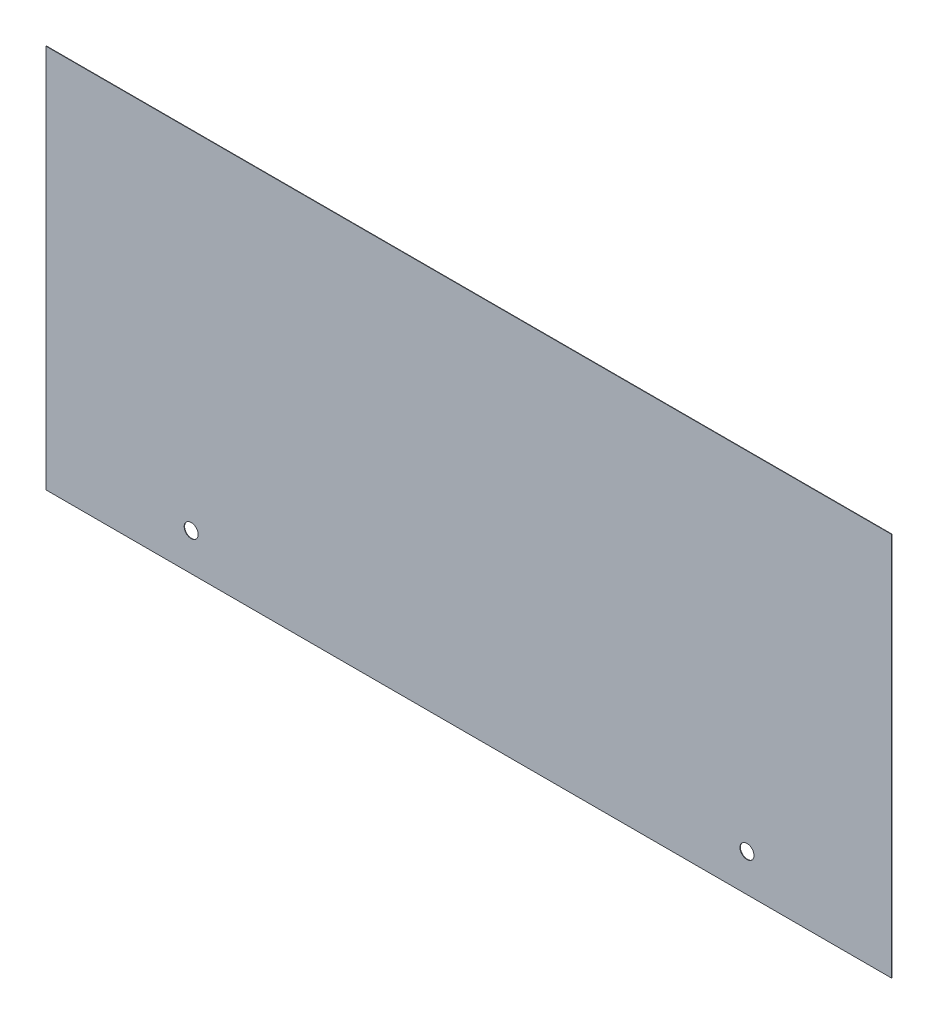
ISO-10303-21;
HEADER;
FILE_DESCRIPTION(('STEP AP214'),'2;1');
FILE_NAME('part.step','',(''),(''),'','','');
FILE_SCHEMA(('AUTOMOTIVE_DESIGN { 1 0 10303 214 1 1 1 1 }'));
ENDSEC;
DATA;
#1=APPLICATION_CONTEXT('core data for automotive mechanical design processes');
#2=APPLICATION_PROTOCOL_DEFINITION('international standard','automotive_design',2000,#1);
#3=PRODUCT_CONTEXT('',#1,'mechanical');
#4=PRODUCT('Part','Part','',(#3));
#5=PRODUCT_RELATED_PRODUCT_CATEGORY('part','',(#4));
#6=PRODUCT_DEFINITION_FORMATION('','',#4);
#7=PRODUCT_DEFINITION_CONTEXT('part definition',#1,'design');
#8=PRODUCT_DEFINITION('design','',#6,#7);
#9=PRODUCT_DEFINITION_SHAPE('','',#8);
#10=(LENGTH_UNIT() NAMED_UNIT(*) SI_UNIT(.MILLI.,.METRE.));
#11=(NAMED_UNIT(*) PLANE_ANGLE_UNIT() SI_UNIT($,.RADIAN.));
#12=(NAMED_UNIT(*) SI_UNIT($,.STERADIAN.) SOLID_ANGLE_UNIT());
#13=UNCERTAINTY_MEASURE_WITH_UNIT(LENGTH_MEASURE(1.E-05),#10,'distance_accuracy_value','');
#14=(GEOMETRIC_REPRESENTATION_CONTEXT(3) GLOBAL_UNCERTAINTY_ASSIGNED_CONTEXT((#13)) GLOBAL_UNIT_ASSIGNED_CONTEXT((#10,
#11,#12)) REPRESENTATION_CONTEXT('',''));
#15=CARTESIAN_POINT('',(0.,0.,0.));
#16=DIRECTION('',(0.,0.,1.));
#17=DIRECTION('',(1.,0.,0.));
#18=AXIS2_PLACEMENT_3D('',#15,#16,#17);
#19=CARTESIAN_POINT('',(-251.3838,-405.0538,0.254));
#20=DIRECTION('',(1.,0.,0.));
#21=DIRECTION('',(0.,0.,-1.));
#22=AXIS2_PLACEMENT_3D('',#19,#20,#21);
#23=PLANE('',#22);
#24=DIRECTION('',(0.,-1.,0.));
#25=VECTOR('',#24,1.);
#26=CARTESIAN_POINT('',(-251.3838,-405.0538,0.254));
#27=LINE('',#26,#25);
#28=CARTESIAN_POINT('',(-251.3838,-176.4538,0.254));
#29=VERTEX_POINT('',#28);
#30=CARTESIAN_POINT('',(-251.3838,-405.0538,0.254));
#31=VERTEX_POINT('',#30);
#32=EDGE_CURVE('E85',#29,#31,#27,.T.);
#33=ORIENTED_EDGE('',*,*,#32,.F.);
#34=DIRECTION('',(0.,0.,1.));
#35=VECTOR('',#34,1.);
#36=CARTESIAN_POINT('',(-251.3838,-176.4538,0.));
#37=LINE('',#36,#35);
#38=CARTESIAN_POINT('',(-251.3838,-176.4538,0.));
#39=VERTEX_POINT('',#38);
#40=EDGE_CURVE('E104',#39,#29,#37,.T.);
#41=ORIENTED_EDGE('',*,*,#40,.F.);
#42=DIRECTION('',(0.,-1.,0.));
#43=VECTOR('',#42,1.);
#44=CARTESIAN_POINT('',(-251.3838,-405.0538,0.));
#45=LINE('',#44,#43);
#46=CARTESIAN_POINT('',(-251.3838,-405.0538,0.));
#47=VERTEX_POINT('',#46);
#48=EDGE_CURVE('E77',#39,#47,#45,.T.);
#49=ORIENTED_EDGE('',*,*,#48,.T.);
#50=DIRECTION('',(0.,0.,-1.));
#51=VECTOR('',#50,1.);
#52=CARTESIAN_POINT('',(-251.3838,-405.0538,0.254));
#53=LINE('',#52,#51);
#54=EDGE_CURVE('E11',#31,#47,#53,.T.);
#55=ORIENTED_EDGE('',*,*,#54,.F.);
#56=EDGE_LOOP('',(#33,#41,#49,#55));
#57=FACE_BOUND('',#56,.T.);
#58=ADVANCED_FACE('F33',(#57),#23,.F.);
#59=CARTESIAN_POINT('',(251.3838,-405.0538,0.254));
#60=DIRECTION('',(0.,1.,0.));
#61=DIRECTION('',(-1.,0.,0.));
#62=AXIS2_PLACEMENT_3D('',#59,#60,#61);
#63=PLANE('',#62);
#64=DIRECTION('',(1.,0.,0.));
#65=VECTOR('',#64,1.);
#66=CARTESIAN_POINT('',(251.3838,-405.0538,0.));
#67=LINE('',#66,#65);
#68=CARTESIAN_POINT('',(251.3838,-405.0538,0.));
#69=VERTEX_POINT('',#68);
#70=EDGE_CURVE('E68',#47,#69,#67,.T.);
#71=ORIENTED_EDGE('',*,*,#70,.T.);
#72=DIRECTION('',(0.,0.,-1.));
#73=VECTOR('',#72,1.);
#74=CARTESIAN_POINT('',(251.3838,-405.0538,0.254));
#75=LINE('',#74,#73);
#76=CARTESIAN_POINT('',(251.3838,-405.0538,0.254));
#77=VERTEX_POINT('',#76);
#78=EDGE_CURVE('E40',#77,#69,#75,.T.);
#79=ORIENTED_EDGE('',*,*,#78,.F.);
#80=DIRECTION('',(1.,0.,0.));
#81=VECTOR('',#80,1.);
#82=CARTESIAN_POINT('',(251.3838,-405.0538,0.254));
#83=LINE('',#82,#81);
#84=EDGE_CURVE('E56',#31,#77,#83,.T.);
#85=ORIENTED_EDGE('',*,*,#84,.F.);
#86=ORIENTED_EDGE('',*,*,#54,.T.);
#87=EDGE_LOOP('',(#71,#79,#85,#86));
#88=FACE_BOUND('',#87,.T.);
#89=ADVANCED_FACE('F70',(#88),#63,.F.);
#90=CARTESIAN_POINT('',(251.3838,-405.0538,0.254));
#91=DIRECTION('',(-1.,0.,0.));
#92=DIRECTION('',(0.,0.,1.));
#93=AXIS2_PLACEMENT_3D('',#90,#91,#92);
#94=PLANE('',#93);
#95=DIRECTION('',(0.,1.,0.));
#96=VECTOR('',#95,1.);
#97=CARTESIAN_POINT('',(251.3838,-405.0538,0.));
#98=LINE('',#97,#96);
#99=CARTESIAN_POINT('',(251.3838,-176.4538,0.));
#100=VERTEX_POINT('',#99);
#101=EDGE_CURVE('E76',#69,#100,#98,.T.);
#102=ORIENTED_EDGE('',*,*,#101,.T.);
#103=DIRECTION('',(0.,0.,1.));
#104=VECTOR('',#103,1.);
#105=CARTESIAN_POINT('',(251.3838,-176.4538,0.));
#106=LINE('',#105,#104);
#107=CARTESIAN_POINT('',(251.3838,-176.4538,0.254));
#108=VERTEX_POINT('',#107);
#109=EDGE_CURVE('E47',#100,#108,#106,.T.);
#110=ORIENTED_EDGE('',*,*,#109,.T.);
#111=DIRECTION('',(0.,1.,0.));
#112=VECTOR('',#111,1.);
#113=CARTESIAN_POINT('',(251.3838,-405.0538,0.254));
#114=LINE('',#113,#112);
#115=EDGE_CURVE('E82',#77,#108,#114,.T.);
#116=ORIENTED_EDGE('',*,*,#115,.F.);
#117=ORIENTED_EDGE('',*,*,#78,.T.);
#118=EDGE_LOOP('',(#102,#110,#116,#117));
#119=FACE_BOUND('',#118,.T.);
#120=ADVANCED_FACE('F81',(#119),#94,.F.);
#121=CARTESIAN_POINT('',(0.,0.,0.254));
#122=DIRECTION('',(0.,0.,1.));
#123=DIRECTION('',(1.,0.,0.));
#124=AXIS2_PLACEMENT_3D('',#121,#122,#123);
#125=PLANE('',#124);
#126=DIRECTION('',(1.,0.,0.));
#127=VECTOR('',#126,1.);
#128=CARTESIAN_POINT('',(-251.3838,-176.4538,0.254));
#129=LINE('',#128,#127);
#130=EDGE_CURVE('E108',#29,#108,#129,.T.);
#131=ORIENTED_EDGE('',*,*,#130,.F.);
#132=ORIENTED_EDGE('',*,*,#32,.T.);
#133=ORIENTED_EDGE('',*,*,#84,.T.);
#134=ORIENTED_EDGE('',*,*,#115,.T.);
#135=EDGE_LOOP('',(#131,#132,#133,#134));
#136=FACE_BOUND('',#135,.T.);
#137=CARTESIAN_POINT('',(-165.1254,-382.8288,0.254));
#138=DIRECTION('',(0.,0.,-1.));
#139=DIRECTION('',(-1.,0.,0.));
#140=AXIS2_PLACEMENT_3D('',#137,#138,#139);
#141=CIRCLE('',#140,4.16559999999999);
#142=CARTESIAN_POINT('',(-169.291,-382.8288,0.254));
#143=VERTEX_POINT('',#142);
#144=EDGE_CURVE('E90',#143,#143,#141,.T.);
#145=ORIENTED_EDGE('',*,*,#144,.T.);
#146=EDGE_LOOP('',(#145));
#147=FACE_BOUND('',#146,.T.);
#148=CARTESIAN_POINT('',(165.481,-382.8288,0.254));
#149=DIRECTION('',(0.,0.,-1.));
#150=DIRECTION('',(-1.,0.,0.));
#151=AXIS2_PLACEMENT_3D('',#148,#149,#150);
#152=CIRCLE('',#151,4.16559999999999);
#153=CARTESIAN_POINT('',(161.3154,-382.8288,0.254));
#154=VERTEX_POINT('',#153);
#155=EDGE_CURVE('E96',#154,#154,#152,.T.);
#156=ORIENTED_EDGE('',*,*,#155,.T.);
#157=EDGE_LOOP('',(#156));
#158=FACE_BOUND('',#157,.T.);
#159=ADVANCED_FACE('F116',(#136,#147,#158),#125,.T.);
#160=CARTESIAN_POINT('',(0.,0.,0.));
#161=DIRECTION('',(0.,0.,1.));
#162=DIRECTION('',(1.,0.,0.));
#163=AXIS2_PLACEMENT_3D('',#160,#161,#162);
#164=PLANE('',#163);
#165=CARTESIAN_POINT('',(-165.1254,-382.8288,0.));
#166=DIRECTION('',(0.,0.,-1.));
#167=DIRECTION('',(-1.,0.,0.));
#168=AXIS2_PLACEMENT_3D('',#165,#166,#167);
#169=CIRCLE('',#168,4.16559999999999);
#170=CARTESIAN_POINT('',(-169.291,-382.8288,0.));
#171=VERTEX_POINT('',#170);
#172=EDGE_CURVE('E99',#171,#171,#169,.T.);
#173=ORIENTED_EDGE('',*,*,#172,.F.);
#174=EDGE_LOOP('',(#173));
#175=FACE_BOUND('',#174,.T.);
#176=CARTESIAN_POINT('',(165.481,-382.8288,0.));
#177=DIRECTION('',(0.,0.,-1.));
#178=DIRECTION('',(-1.,0.,0.));
#179=AXIS2_PLACEMENT_3D('',#176,#177,#178);
#180=CIRCLE('',#179,4.16559999999999);
#181=CARTESIAN_POINT('',(161.3154,-382.8288,0.));
#182=VERTEX_POINT('',#181);
#183=EDGE_CURVE('E93',#182,#182,#180,.T.);
#184=ORIENTED_EDGE('',*,*,#183,.F.);
#185=EDGE_LOOP('',(#184));
#186=FACE_BOUND('',#185,.T.);
#187=ORIENTED_EDGE('',*,*,#48,.F.);
#188=DIRECTION('',(1.,0.,0.));
#189=VECTOR('',#188,1.);
#190=CARTESIAN_POINT('',(-251.3838,-176.4538,0.));
#191=LINE('',#190,#189);
#192=EDGE_CURVE('E84',#39,#100,#191,.T.);
#193=ORIENTED_EDGE('',*,*,#192,.T.);
#194=ORIENTED_EDGE('',*,*,#101,.F.);
#195=ORIENTED_EDGE('',*,*,#70,.F.);
#196=EDGE_LOOP('',(#187,#193,#194,#195));
#197=FACE_BOUND('',#196,.T.);
#198=ADVANCED_FACE('F83',(#175,#186,#197),#164,.F.);
#199=CARTESIAN_POINT('',(165.481,-382.8288,0.254));
#200=DIRECTION('',(0.,0.,-1.));
#201=DIRECTION('',(-1.,0.,0.));
#202=AXIS2_PLACEMENT_3D('',#199,#200,#201);
#203=CYLINDRICAL_SURFACE('',#202,4.16559999999999);
#204=ORIENTED_EDGE('',*,*,#155,.F.);
#205=EDGE_LOOP('',(#204));
#206=FACE_BOUND('',#205,.T.);
#207=ORIENTED_EDGE('',*,*,#183,.T.);
#208=EDGE_LOOP('',(#207));
#209=FACE_BOUND('',#208,.T.);
#210=ADVANCED_FACE('F124',(#206,#209),#203,.F.);
#211=CARTESIAN_POINT('',(-165.1254,-382.8288,0.254));
#212=DIRECTION('',(0.,0.,-1.));
#213=DIRECTION('',(-1.,0.,0.));
#214=AXIS2_PLACEMENT_3D('',#211,#212,#213);
#215=CYLINDRICAL_SURFACE('',#214,4.16559999999999);
#216=ORIENTED_EDGE('',*,*,#144,.F.);
#217=EDGE_LOOP('',(#216));
#218=FACE_BOUND('',#217,.T.);
#219=ORIENTED_EDGE('',*,*,#172,.T.);
#220=EDGE_LOOP('',(#219));
#221=FACE_BOUND('',#220,.T.);
#222=ADVANCED_FACE('F127',(#218,#221),#215,.F.);
#223=CARTESIAN_POINT('',(-251.3838,-176.4538,0.));
#224=DIRECTION('',(0.,-1.,0.));
#225=DIRECTION('',(1.,0.,0.));
#226=AXIS2_PLACEMENT_3D('',#223,#224,#225);
#227=PLANE('',#226);
#228=ORIENTED_EDGE('',*,*,#130,.T.);
#229=ORIENTED_EDGE('',*,*,#109,.F.);
#230=ORIENTED_EDGE('',*,*,#192,.F.);
#231=ORIENTED_EDGE('',*,*,#40,.T.);
#232=EDGE_LOOP('',(#228,#229,#230,#231));
#233=FACE_BOUND('',#232,.T.);
#234=ADVANCED_FACE('F112',(#233),#227,.F.);
#235=CLOSED_SHELL('',(#58,#89,#120,#159,#198,#210,#222,#234));
#236=MANIFOLD_SOLID_BREP('B2',#235);
#237=ADVANCED_BREP_SHAPE_REPRESENTATION('',(#18,#236),#14);
#238=SHAPE_DEFINITION_REPRESENTATION(#9,#237);
ENDSEC;
END-ISO-10303-21;
